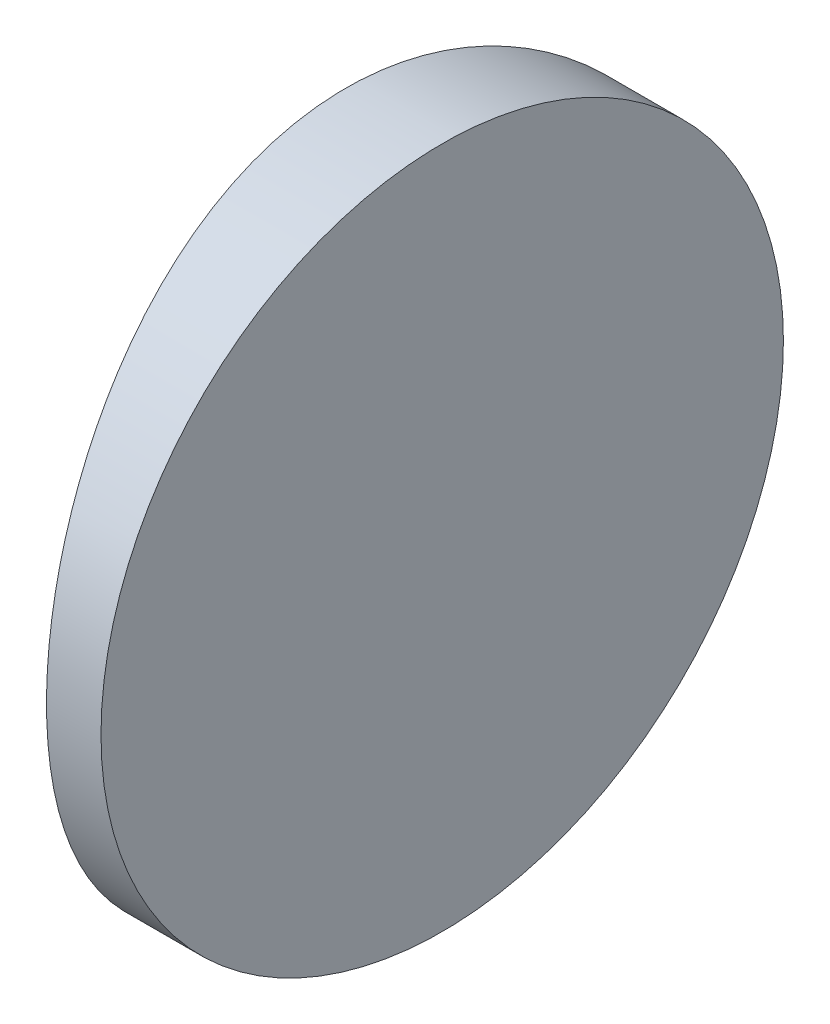
ISO-10303-21;
HEADER;
FILE_DESCRIPTION(('STEP AP214'),'2;1');
FILE_NAME('part.step','',(''),(''),'','','');
FILE_SCHEMA(('AUTOMOTIVE_DESIGN { 1 0 10303 214 1 1 1 1 }'));
ENDSEC;
DATA;
#1=APPLICATION_CONTEXT('core data for automotive mechanical design processes');
#2=APPLICATION_PROTOCOL_DEFINITION('international standard','automotive_design',2000,#1);
#3=PRODUCT_CONTEXT('',#1,'mechanical');
#4=PRODUCT('Part','Part','',(#3));
#5=PRODUCT_RELATED_PRODUCT_CATEGORY('part','',(#4));
#6=PRODUCT_DEFINITION_FORMATION('','',#4);
#7=PRODUCT_DEFINITION_CONTEXT('part definition',#1,'design');
#8=PRODUCT_DEFINITION('design','',#6,#7);
#9=PRODUCT_DEFINITION_SHAPE('','',#8);
#10=(LENGTH_UNIT() NAMED_UNIT(*) SI_UNIT(.MILLI.,.METRE.));
#11=(NAMED_UNIT(*) PLANE_ANGLE_UNIT() SI_UNIT($,.RADIAN.));
#12=(NAMED_UNIT(*) SI_UNIT($,.STERADIAN.) SOLID_ANGLE_UNIT());
#13=UNCERTAINTY_MEASURE_WITH_UNIT(LENGTH_MEASURE(1.E-05),#10,'distance_accuracy_value','');
#14=(GEOMETRIC_REPRESENTATION_CONTEXT(3) GLOBAL_UNCERTAINTY_ASSIGNED_CONTEXT((#13)) GLOBAL_UNIT_ASSIGNED_CONTEXT((#10,
#11,#12)) REPRESENTATION_CONTEXT('',''));
#15=CARTESIAN_POINT('',(0.,0.,0.));
#16=DIRECTION('',(0.,0.,1.));
#17=DIRECTION('',(1.,0.,0.));
#18=AXIS2_PLACEMENT_3D('',#15,#16,#17);
#19=CARTESIAN_POINT('',(4.35520433485127,25.,0.));
#20=DIRECTION('',(0.,-1.,0.));
#21=DIRECTION('',(0.,0.,-1.));
#22=AXIS2_PLACEMENT_3D('',#19,#20,#21);
#23=CYLINDRICAL_SURFACE('',#22,51.68);
#24=CARTESIAN_POINT('',(-47.3247956651487,0.,0.));
#25=CARTESIAN_POINT('',(-47.324798710841,-5.19999740793087E-06,-0.345686023519313));
#26=CARTESIAN_POINT('',(-47.3213207601668,0.0143453784578934,-0.691303686348246));
#27=CARTESIAN_POINT('',(-47.307511659146,0.0716194430874397,-1.3801332807427));
#28=CARTESIAN_POINT('',(-47.2971790682304,0.114548935403734,-1.72334469128567));
#29=CARTESIAN_POINT('',(-47.269931146604,0.228681065624344,-2.40505613051129));
#30=CARTESIAN_POINT('',(-47.2530102268401,0.299907709795103,-2.74355190558979));
#31=CARTESIAN_POINT('',(-47.2130543163359,0.470048446955663,-3.41314975634674));
#32=CARTESIAN_POINT('',(-47.1900191755266,0.56896321953269,-3.74425165033174));
#33=CARTESIAN_POINT('',(-47.1385005624269,0.793541831811986,-4.39631545213668));
#34=CARTESIAN_POINT('',(-47.1100244016907,0.919169800037062,-4.71729030166341));
#35=CARTESIAN_POINT('',(-47.0483745345037,1.19629441139304,-5.34740153374515));
#36=CARTESIAN_POINT('',(-47.015200774875,1.34779134736997,-5.65653778223442));
#37=CARTESIAN_POINT('',(-46.9450571699555,1.67548953757897,-6.26083680069732));
#38=CARTESIAN_POINT('',(-46.9080885813055,1.85168262080999,-6.55600414940747));
#39=CARTESIAN_POINT('',(-46.8313134086525,2.2276552435087,-7.13070092631414));
#40=CARTESIAN_POINT('',(-46.7915056120495,2.42744488503803,-7.41022358073899));
#41=CARTESIAN_POINT('',(-46.709415077535,2.85286288099438,-7.95642125486838));
#42=CARTESIAN_POINT('',(-46.6671014017823,3.07887906158169,-8.22278962405948));
#43=CARTESIAN_POINT('',(-46.5818210768029,3.55224486433831,-8.7355237293507));
#44=CARTESIAN_POINT('',(-46.5388546978032,3.79958584595569,-8.98189748919984));
#45=CARTESIAN_POINT('',(-46.4534125885195,4.31418613779817,-9.45326737080424));
#46=CARTESIAN_POINT('',(-46.4109371281143,4.58145585332278,-9.67825218339712));
#47=CARTESIAN_POINT('',(-46.3276826291943,5.13404975583938,-10.1051810680998));
#48=CARTESIAN_POINT('',(-46.2869035767737,5.4193737947865,-10.3071253291033));
#49=CARTESIAN_POINT('',(-46.2076305824039,6.01040625567271,-10.68928282009));
#50=CARTESIAN_POINT('',(-46.1691775634089,6.31634749855627,-10.8691447422922));
#51=CARTESIAN_POINT('',(-46.0963391699643,6.94278749998935,-11.2023773850436));
#52=CARTESIAN_POINT('',(-46.0619536931739,7.2632858919949,-11.3557487721488));
#53=CARTESIAN_POINT('',(-45.9983192006485,7.91629339453773,-11.6346696056547));
#54=CARTESIAN_POINT('',(-45.9690650595835,8.24879011579401,-11.7602468468858));
#55=CARTESIAN_POINT('',(-45.9165566503915,8.92358392854503,-11.9827157290301));
#56=CARTESIAN_POINT('',(-45.8933008924964,9.26587856310609,-12.079614493459));
#57=CARTESIAN_POINT('',(-45.8462691621705,10.0839690633338,-12.2738751086462));
#58=CARTESIAN_POINT('',(-45.8253857757078,10.5630021304001,-12.3585640518819));
#59=CARTESIAN_POINT('',(-45.7974077798227,11.5280687237149,-12.4716218359881));
#60=CARTESIAN_POINT('',(-45.7903126908361,12.0141020059002,-12.4999926356334));
#61=CARTESIAN_POINT('',(-45.7903045393985,12.8455198535917,-12.5000052367675));
#62=CARTESIAN_POINT('',(-45.7938864225254,13.190971297851,-12.4856683112766));
#63=CARTESIAN_POINT('',(-45.8080984682535,13.8794638682386,-12.428450140012));
#64=CARTESIAN_POINT('',(-45.8187301172551,14.2225044706374,-12.3855628745645));
#65=CARTESIAN_POINT('',(-45.8467376359471,14.9038701888722,-12.2715462888543));
#66=CARTESIAN_POINT('',(-45.8641192885942,15.242191002941,-12.2003927507143));
#67=CARTESIAN_POINT('',(-45.9051053771024,15.9114351785053,-12.0304323449959));
#68=CARTESIAN_POINT('',(-45.9287099762429,16.2423583456517,-11.9316247518177));
#69=CARTESIAN_POINT('',(-45.9814091172049,16.8940418097404,-11.7073048502882));
#70=CARTESIAN_POINT('',(-46.0104958427871,17.2148158257377,-11.5818305303846));
#71=CARTESIAN_POINT('',(-46.0733427257968,17.8445418242371,-11.3050505081049));
#72=CARTESIAN_POINT('',(-46.1071029361327,18.1534936728502,-11.1537445132843));
#73=CARTESIAN_POINT('',(-46.1783314227149,18.7574554489261,-10.826457738502));
#74=CARTESIAN_POINT('',(-46.2157984989839,19.0524698427906,-10.650484935978));
#75=CARTESIAN_POINT('',(-46.2934291761808,19.6269008230846,-10.274973678129));
#76=CARTESIAN_POINT('',(-46.3335939297083,19.9063106477794,-10.0754251219193));
#77=CARTESIAN_POINT('',(-46.4162716890089,20.4526503756731,-9.65025247172365));
#78=CARTESIAN_POINT('',(-46.4588144084386,20.7192533118577,-9.42421389875915));
#79=CARTESIAN_POINT('',(-46.5443461370881,21.2324593595829,-8.9507537888996));
#80=CARTESIAN_POINT('',(-46.5873349592034,21.4790705017718,-8.70334092132881));
#81=CARTESIAN_POINT('',(-46.6726131137529,21.9509065533081,-8.18854901966284));
#82=CARTESIAN_POINT('',(-46.7149020776762,22.1761204743674,-7.92115985153557));
#83=CARTESIAN_POINT('',(-46.7975959363228,22.6034915254631,-7.36827928586115));
#84=CARTESIAN_POINT('',(-46.8380008484377,22.8056488683612,-7.08278805547272));
#85=CARTESIAN_POINT('',(-46.9163416553442,23.1880558961294,-6.49161367171254));
#86=CARTESIAN_POINT('',(-46.9542369434055,23.3679736671186,-6.1857102698136));
#87=CARTESIAN_POINT('',(-47.025876835333,23.7013217617515,-5.55933972042104));
#88=CARTESIAN_POINT('',(-47.0596215422425,23.8547527430005,-5.23887293475196));
#89=CARTESIAN_POINT('',(-47.1219660114678,24.133794118682,-4.58592799758991));
#90=CARTESIAN_POINT('',(-47.1505708483224,24.2594319816125,-4.2534620865963));
#91=CARTESIAN_POINT('',(-47.201847052825,24.4820216551797,-3.57873934052725));
#92=CARTESIAN_POINT('',(-47.224519881654,24.5789805308364,-3.23648493965229));
#93=CARTESIAN_POINT('',(-47.2703609696884,24.773496951191,-2.41803884254382));
#94=CARTESIAN_POINT('',(-47.2906832834927,24.8583286076343,-1.93860158802478));
#95=CARTESIAN_POINT('',(-47.3178982793897,24.9715755941581,-0.97273098168922));
#96=CARTESIAN_POINT('',(-47.3247913805856,24.999992684843,-0.486297848679622));
#97=CARTESIAN_POINT('',(-47.324798710841,25.0000051999974,0.345686023519342));
#98=CARTESIAN_POINT('',(-47.3213207601668,24.9856546215421,0.691303686348275));
#99=CARTESIAN_POINT('',(-47.307511659146,24.9283805569126,1.38013328074273));
#100=CARTESIAN_POINT('',(-47.2971790682304,24.8854510645963,1.7233446912857));
#101=CARTESIAN_POINT('',(-47.2699311466039,24.7713189343757,2.40505613051132));
#102=CARTESIAN_POINT('',(-47.2530102268401,24.7000922902049,2.74355190558982));
#103=CARTESIAN_POINT('',(-47.2130543163359,24.5299515530443,3.41314975634677));
#104=CARTESIAN_POINT('',(-47.1900191755266,24.4310367804673,3.74425165033177));
#105=CARTESIAN_POINT('',(-47.1385005624269,24.206458168188,4.39631545213671));
#106=CARTESIAN_POINT('',(-47.1100244016907,24.0808301999629,4.71729030166344));
#107=CARTESIAN_POINT('',(-47.0483745345037,23.803705588607,5.34740153374518));
#108=CARTESIAN_POINT('',(-47.015200774875,23.65220865263,5.65653778223445));
#109=CARTESIAN_POINT('',(-46.9450571699555,23.324510462421,6.26083680069735));
#110=CARTESIAN_POINT('',(-46.9080885813055,23.14831737919,6.55600414940749));
#111=CARTESIAN_POINT('',(-46.8313134086525,22.7723447564913,7.13070092631416));
#112=CARTESIAN_POINT('',(-46.7915056120495,22.572555114962,7.41022358073902));
#113=CARTESIAN_POINT('',(-46.709415077535,22.1471371190056,7.95642125486841));
#114=CARTESIAN_POINT('',(-46.6671014017822,21.9211209384183,8.22278962405952));
#115=CARTESIAN_POINT('',(-46.5818210768029,21.4477551356617,8.73552372935074));
#116=CARTESIAN_POINT('',(-46.5388546978032,21.2004141540443,8.98189748919986));
#117=CARTESIAN_POINT('',(-46.4534125885195,20.6858138622018,9.45326737080427));
#118=CARTESIAN_POINT('',(-46.4109371281143,20.4185441466772,9.67825218339715));
#119=CARTESIAN_POINT('',(-46.3276826291943,19.8659502441606,10.1051810680998));
#120=CARTESIAN_POINT('',(-46.2869035767737,19.5806262052135,10.3071253291033));
#121=CARTESIAN_POINT('',(-46.2076305824039,18.9895937443273,10.68928282009));
#122=CARTESIAN_POINT('',(-46.1691775634089,18.6836525014437,10.8691447422922));
#123=CARTESIAN_POINT('',(-46.0963391699643,18.0572125000106,11.2023773850436));
#124=CARTESIAN_POINT('',(-46.0619536931739,17.7367141080051,11.3557487721488));
#125=CARTESIAN_POINT('',(-45.9983192006484,17.0837066054623,11.6346696056547));
#126=CARTESIAN_POINT('',(-45.9690650595835,16.751209884206,11.7602468468858));
#127=CARTESIAN_POINT('',(-45.9165566503915,16.076416071455,11.9827157290301));
#128=CARTESIAN_POINT('',(-45.8933008924964,15.7341214368939,12.079614493459));
#129=CARTESIAN_POINT('',(-45.8462691621705,14.9160309366662,12.2738751086462));
#130=CARTESIAN_POINT('',(-45.8253857757078,14.4369978695999,12.3585640518819));
#131=CARTESIAN_POINT('',(-45.7974077798227,13.4719312762851,12.4716218359881));
#132=CARTESIAN_POINT('',(-45.7903126908361,12.9858979940998,12.4999926356335));
#133=CARTESIAN_POINT('',(-45.7903045393985,12.1544801464083,12.5000052367676));
#134=CARTESIAN_POINT('',(-45.7938864225254,11.809028702149,12.4856683112766));
#135=CARTESIAN_POINT('',(-45.8080984682535,11.1205361317614,12.428450140012));
#136=CARTESIAN_POINT('',(-45.8187301172551,10.7774955293626,12.3855628745645));
#137=CARTESIAN_POINT('',(-45.846737635947,10.0961298111278,12.2715462888543));
#138=CARTESIAN_POINT('',(-45.8641192885942,9.75780899705896,12.2003927507144));
#139=CARTESIAN_POINT('',(-45.9051053771024,9.08856482149472,12.030432344996));
#140=CARTESIAN_POINT('',(-45.9287099762429,8.75764165434826,11.9316247518177));
#141=CARTESIAN_POINT('',(-45.9814091172049,8.10595819025965,11.7073048502882));
#142=CARTESIAN_POINT('',(-46.0104958427871,7.78518417426235,11.5818305303847));
#143=CARTESIAN_POINT('',(-46.0733427257968,7.15545817576289,11.305050508105));
#144=CARTESIAN_POINT('',(-46.1071029361327,6.8465063271498,11.1537445132844));
#145=CARTESIAN_POINT('',(-46.1783314227149,6.24254455107386,10.826457738502));
#146=CARTESIAN_POINT('',(-46.2157984989839,5.94753015720939,10.6504849359781));
#147=CARTESIAN_POINT('',(-46.2934291761808,5.37309917691536,10.274973678129));
#148=CARTESIAN_POINT('',(-46.3335939297083,5.09368935222065,10.0754251219193));
#149=CARTESIAN_POINT('',(-46.4162716890089,4.54734962432686,9.65025247172367));
#150=CARTESIAN_POINT('',(-46.4588144084386,4.28074668814234,9.42421389875918));
#151=CARTESIAN_POINT('',(-46.5443461370881,3.7675406404171,8.95075378889963));
#152=CARTESIAN_POINT('',(-46.5873349592034,3.5209294982282,8.70334092132883));
#153=CARTESIAN_POINT('',(-46.6726131137529,3.04909344669187,8.18854901966286));
#154=CARTESIAN_POINT('',(-46.7149020776762,2.82387952563263,7.92115985153559));
#155=CARTESIAN_POINT('',(-46.7975959363227,2.39650847453694,7.36827928586117));
#156=CARTESIAN_POINT('',(-46.8380008484377,2.1943511316388,7.08278805547275));
#157=CARTESIAN_POINT('',(-46.9163416553441,1.81194410387062,6.49161367171257));
#158=CARTESIAN_POINT('',(-46.9542369434054,1.63202633288141,6.18571026981363));
#159=CARTESIAN_POINT('',(-47.025876835333,1.29867823824851,5.55933972042106));
#160=CARTESIAN_POINT('',(-47.0596215422425,1.14524725699948,5.23887293475199));
#161=CARTESIAN_POINT('',(-47.1219660114678,0.866205881317987,4.58592799758993));
#162=CARTESIAN_POINT('',(-47.1505708483224,0.740568018387502,4.25346208659633));
#163=CARTESIAN_POINT('',(-47.201847052825,0.517978344820328,3.57873934052728));
#164=CARTESIAN_POINT('',(-47.224519881654,0.421019469163622,3.23648493965232));
#165=CARTESIAN_POINT('',(-47.2703609696884,0.226503048809008,2.41803884254385));
#166=CARTESIAN_POINT('',(-47.2906832834927,0.141671392365697,1.93860158802481));
#167=CARTESIAN_POINT('',(-47.3178982793897,0.0284244058419363,0.972730981689248));
#168=CARTESIAN_POINT('',(-47.3247913805856,7.31515703916008E-06,0.48629784867965));
#169=CARTESIAN_POINT('',(-47.3247956651487,0.,0.));
#170=B_SPLINE_CURVE_WITH_KNOTS('',3,(#24,#25,#26,#27,#28,#29,#30,#31,#32,#33,#34,#35,#36,#37,
#38,#39,#40,#41,#42,#43,#44,#45,#46,#47,#48,#49,#50,#51,#52,#53,#54,#55,#56,#57,#58,#59,#60,#61,
#62,#63,#64,#65,#66,#67,#68,#69,#70,#71,#72,#73,#74,#75,#76,#77,#78,#79,#80,#81,#82,#83,#84,#85,
#86,#87,#88,#89,#90,#91,#92,#93,#94,#95,#96,#97,#98,#99,#100,#101,#102,#103,#104,#105,#106,#107,
#108,#109,#110,#111,#112,#113,#114,#115,#116,#117,#118,#119,#120,#121,#122,#123,#124,#125,#126,
#127,#128,#129,#130,#131,#132,#133,#134,#135,#136,#137,#138,#139,#140,#141,#142,#143,#144,#145,
#146,#147,#148,#149,#150,#151,#152,#153,#154,#155,#156,#157,#158,#159,#160,#161,#162,#163,#164,
#165,#166,#167,#168,#169),.UNSPECIFIED.,.T.,.F.,(4,2,2,2,2,2,2,2,2,2,2,2,2,2,2,2,2,2,2,2,2,2,2,
2,2,2,2,2,2,2,2,2,2,2,2,2,2,2,2,2,2,2,2,2,2,2,2,2,2,2,2,2,2,2,2,2,2,2,2,2,2,2,2,2,2,2,2,2,2,2,2,
2,4),(0.,1.03662565183733,2.07346922963558,3.11119431232833,4.14894486754655,5.18531059494541,
6.22168805515559,7.25772342398079,8.29420395483673,9.34864909735849,10.4026689815073,
11.457243102749,12.5118085776381,13.5814259034206,14.6510163115231,15.7195322209847,
16.7877824960307,18.2449181276583,19.7020030784502,20.7381295596903,21.7744745714226,
22.8117094208132,23.848971488198,24.8847656974962,25.9205716339594,26.956043352294,
27.9919603319271,29.0470626746643,30.1017390636143,31.1569541742214,32.212159542141,
33.2815838541974,34.3509816111169,35.4193176913592,36.4873903691994,37.9457211179399,
39.404006353896,40.4406320057333,41.4774755835316,42.5152006662244,43.5529512214426,
44.5893169488414,45.6256944090516,46.6617297778768,47.6982103087328,48.7526554512545,
49.8066753354034,50.861249456645,51.9158149315341,52.9854322573166,54.0550226654192,
55.1235385748808,56.1917888499267,57.6489244815543,59.1060094323462,60.1421359135863,
61.1784809253186,62.2157157747092,63.252977842094,64.2887720513922,65.3245779878554,
66.36004970619,67.3959666858232,68.4510690285604,69.5057454175103,70.5609605281175,
71.616165896037,72.6855902080934,73.7549879650129,74.8233240452552,75.8913967230954,
77.3497274718359,78.8080127077921),.UNSPECIFIED.);
#171=CARTESIAN_POINT('',(-47.3247956651487,0.,0.));
#172=VERTEX_POINT('',#171);
#173=EDGE_CURVE('E10',#172,#172,#170,.T.);
#174=ORIENTED_EDGE('',*,*,#173,.F.);
#175=EDGE_LOOP('',(#174));
#176=FACE_BOUND('',#175,.T.);
#177=ADVANCED_FACE('F33',(#176),#23,.T.);
#178=CARTESIAN_POINT('',(-43.7947956651487,25.,-12.5));
#179=DIRECTION('',(1.,0.,0.));
#180=DIRECTION('',(0.,0.,-1.));
#181=AXIS2_PLACEMENT_3D('',#178,#179,#180);
#182=PLANE('',#181);
#183=CARTESIAN_POINT('',(-43.7947956651487,12.5,0.));
#184=DIRECTION('',(1.,0.,0.));
#185=DIRECTION('',(0.,0.,-1.));
#186=AXIS2_PLACEMENT_3D('',#183,#184,#185);
#187=CIRCLE('',#186,12.5);
#188=CARTESIAN_POINT('',(-43.7947956651487,12.5,-12.5));
#189=VERTEX_POINT('',#188);
#190=EDGE_CURVE('E43',#189,#189,#187,.T.);
#191=ORIENTED_EDGE('',*,*,#190,.T.);
#192=EDGE_LOOP('',(#191));
#193=FACE_BOUND('',#192,.T.);
#194=ADVANCED_FACE('F35',(#193),#182,.T.);
#195=CARTESIAN_POINT('',(-56.4947956651487,12.5,0.));
#196=DIRECTION('',(1.,0.,0.));
#197=DIRECTION('',(0.,0.,-1.));
#198=AXIS2_PLACEMENT_3D('',#195,#196,#197);
#199=CYLINDRICAL_SURFACE('',#198,12.5);
#200=ORIENTED_EDGE('',*,*,#190,.F.);
#201=EDGE_LOOP('',(#200));
#202=FACE_BOUND('',#201,.T.);
#203=ORIENTED_EDGE('',*,*,#173,.T.);
#204=EDGE_LOOP('',(#203));
#205=FACE_BOUND('',#204,.T.);
#206=ADVANCED_FACE('F50',(#202,#205),#199,.T.);
#207=CLOSED_SHELL('',(#177,#194,#206));
#208=MANIFOLD_SOLID_BREP('B2',#207);
#209=ADVANCED_BREP_SHAPE_REPRESENTATION('',(#18,#208),#14);
#210=SHAPE_DEFINITION_REPRESENTATION(#9,#209);
ENDSEC;
END-ISO-10303-21;
